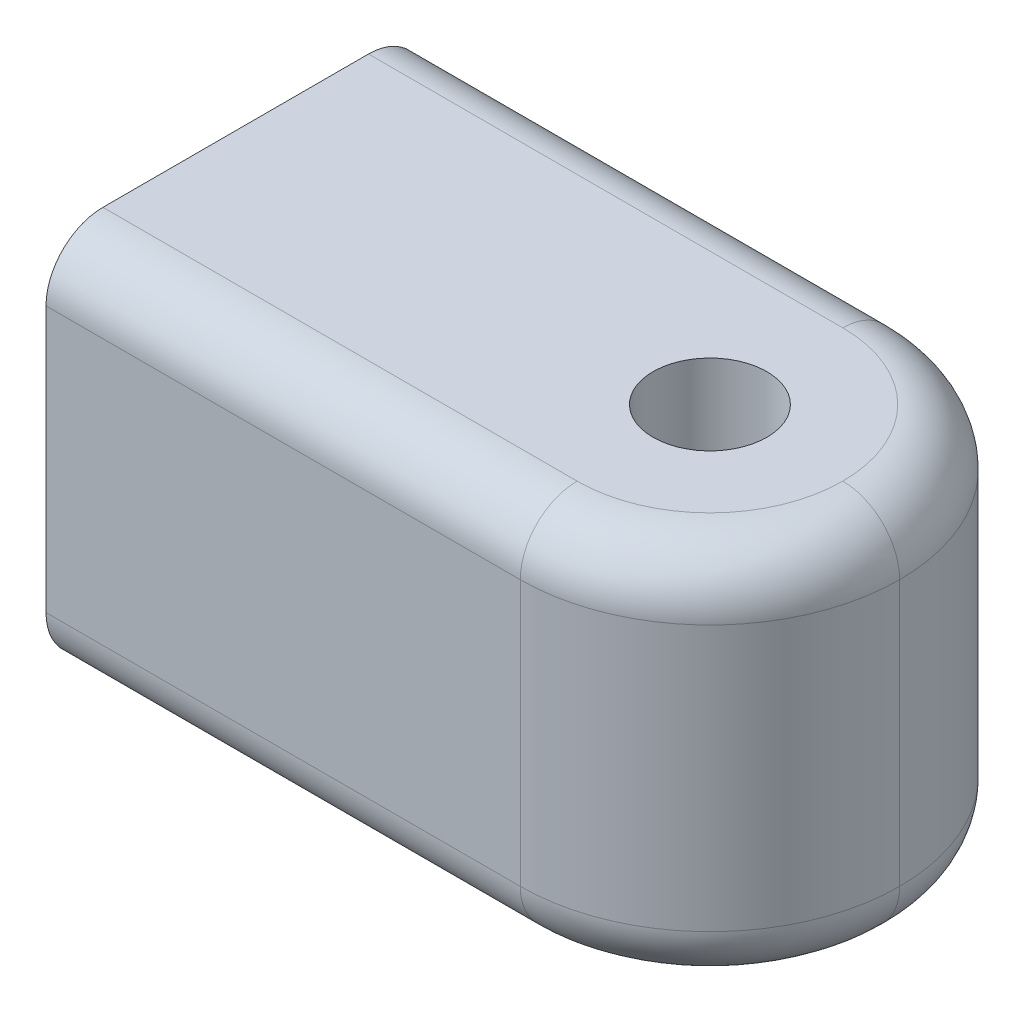
ISO-10303-21;
HEADER;
FILE_DESCRIPTION(('STEP AP214'),'2;1');
FILE_NAME('part.step','',(''),(''),'','','');
FILE_SCHEMA(('AUTOMOTIVE_DESIGN { 1 0 10303 214 1 1 1 1 }'));
ENDSEC;
DATA;
#1=APPLICATION_CONTEXT('core data for automotive mechanical design processes');
#2=APPLICATION_PROTOCOL_DEFINITION('international standard','automotive_design',2000,#1);
#3=PRODUCT_CONTEXT('',#1,'mechanical');
#4=PRODUCT('Part','Part','',(#3));
#5=PRODUCT_RELATED_PRODUCT_CATEGORY('part','',(#4));
#6=PRODUCT_DEFINITION_FORMATION('','',#4);
#7=PRODUCT_DEFINITION_CONTEXT('part definition',#1,'design');
#8=PRODUCT_DEFINITION('design','',#6,#7);
#9=PRODUCT_DEFINITION_SHAPE('','',#8);
#10=(LENGTH_UNIT() NAMED_UNIT(*) SI_UNIT(.MILLI.,.METRE.));
#11=(NAMED_UNIT(*) PLANE_ANGLE_UNIT() SI_UNIT($,.RADIAN.));
#12=(NAMED_UNIT(*) SI_UNIT($,.STERADIAN.) SOLID_ANGLE_UNIT());
#13=UNCERTAINTY_MEASURE_WITH_UNIT(LENGTH_MEASURE(1.E-05),#10,'distance_accuracy_value','');
#14=(GEOMETRIC_REPRESENTATION_CONTEXT(3) GLOBAL_UNCERTAINTY_ASSIGNED_CONTEXT((#13)) GLOBAL_UNIT_ASSIGNED_CONTEXT((#10,
#11,#12)) REPRESENTATION_CONTEXT('',''));
#15=CARTESIAN_POINT('',(0.,0.,0.));
#16=DIRECTION('',(0.,0.,1.));
#17=DIRECTION('',(1.,0.,0.));
#18=AXIS2_PLACEMENT_3D('',#15,#16,#17);
#19=CARTESIAN_POINT('',(0.,0.,0.));
#20=DIRECTION('',(1.,0.,0.));
#21=DIRECTION('',(0.,0.,-1.));
#22=AXIS2_PLACEMENT_3D('',#19,#20,#21);
#23=PLANE('',#22);
#24=DIRECTION('',(0.,0.,-1.));
#25=VECTOR('',#24,1.);
#26=CARTESIAN_POINT('',(0.,-10.,10.));
#27=LINE('',#26,#25);
#28=CARTESIAN_POINT('',(0.,-10.,7.));
#29=VERTEX_POINT('',#28);
#30=CARTESIAN_POINT('',(0.,-10.,-7.));
#31=VERTEX_POINT('',#30);
#32=EDGE_CURVE('E149',#29,#31,#27,.T.);
#33=ORIENTED_EDGE('',*,*,#32,.F.);
#34=CARTESIAN_POINT('',(0.,-7.,7.));
#35=DIRECTION('',(1.,0.,0.));
#36=DIRECTION('',(0.,0.,-1.));
#37=AXIS2_PLACEMENT_3D('',#34,#35,#36);
#38=CIRCLE('',#37,3.);
#39=CARTESIAN_POINT('',(0.,-7.,10.));
#40=VERTEX_POINT('',#39);
#41=EDGE_CURVE('E133',#29,#40,#38,.F.);
#42=ORIENTED_EDGE('',*,*,#41,.T.);
#43=DIRECTION('',(0.,1.,0.));
#44=VECTOR('',#43,1.);
#45=CARTESIAN_POINT('',(0.,-10.,10.));
#46=LINE('',#45,#44);
#47=CARTESIAN_POINT('',(0.,7.,10.));
#48=VERTEX_POINT('',#47);
#49=EDGE_CURVE('E160',#40,#48,#46,.T.);
#50=ORIENTED_EDGE('',*,*,#49,.T.);
#51=CARTESIAN_POINT('',(0.,7.,7.));
#52=DIRECTION('',(1.,0.,0.));
#53=DIRECTION('',(0.,0.,-1.));
#54=AXIS2_PLACEMENT_3D('',#51,#52,#53);
#55=CIRCLE('',#54,3.);
#56=CARTESIAN_POINT('',(0.,10.,7.));
#57=VERTEX_POINT('',#56);
#58=EDGE_CURVE('E144',#48,#57,#55,.F.);
#59=ORIENTED_EDGE('',*,*,#58,.T.);
#60=DIRECTION('',(0.,0.,-1.));
#61=VECTOR('',#60,1.);
#62=CARTESIAN_POINT('',(0.,10.,10.));
#63=LINE('',#62,#61);
#64=CARTESIAN_POINT('',(0.,10.,-7.));
#65=VERTEX_POINT('',#64);
#66=EDGE_CURVE('E166',#57,#65,#63,.T.);
#67=ORIENTED_EDGE('',*,*,#66,.T.);
#68=CARTESIAN_POINT('',(0.,7.,-7.));
#69=DIRECTION('',(1.,0.,0.));
#70=DIRECTION('',(0.,0.,-1.));
#71=AXIS2_PLACEMENT_3D('',#68,#69,#70);
#72=CIRCLE('',#71,3.);
#73=CARTESIAN_POINT('',(0.,7.,-10.));
#74=VERTEX_POINT('',#73);
#75=EDGE_CURVE('E154',#65,#74,#72,.F.);
#76=ORIENTED_EDGE('',*,*,#75,.T.);
#77=DIRECTION('',(0.,1.,0.));
#78=VECTOR('',#77,1.);
#79=CARTESIAN_POINT('',(0.,-10.,-10.));
#80=LINE('',#79,#78);
#81=CARTESIAN_POINT('',(0.,-7.,-10.));
#82=VERTEX_POINT('',#81);
#83=EDGE_CURVE('E161',#82,#74,#80,.T.);
#84=ORIENTED_EDGE('',*,*,#83,.F.);
#85=CARTESIAN_POINT('',(0.,-7.,-7.));
#86=DIRECTION('',(1.,0.,0.));
#87=DIRECTION('',(0.,0.,-1.));
#88=AXIS2_PLACEMENT_3D('',#85,#86,#87);
#89=CIRCLE('',#88,3.);
#90=EDGE_CURVE('E159',#82,#31,#89,.F.);
#91=ORIENTED_EDGE('',*,*,#90,.T.);
#92=EDGE_LOOP('',(#33,#42,#50,#59,#67,#76,#84,#91));
#93=FACE_BOUND('',#92,.T.);
#94=CARTESIAN_POINT('',(0.,0.,0.));
#95=DIRECTION('',(1.,0.,0.));
#96=DIRECTION('',(0.,0.,-1.));
#97=AXIS2_PLACEMENT_3D('',#94,#95,#96);
#98=CIRCLE('',#97,5.3);
#99=CARTESIAN_POINT('',(0.,0.,-5.3));
#100=VERTEX_POINT('',#99);
#101=EDGE_CURVE('E231',#100,#100,#98,.T.);
#102=ORIENTED_EDGE('',*,*,#101,.T.);
#103=EDGE_LOOP('',(#102));
#104=FACE_BOUND('',#103,.T.);
#105=ADVANCED_FACE('F56',(#93,#104),#23,.F.);
#106=CARTESIAN_POINT('',(10.,10.,10.));
#107=DIRECTION('',(0.,1.,0.));
#108=DIRECTION('',(0.,0.,1.));
#109=AXIS2_PLACEMENT_3D('',#106,#107,#108);
#110=PLANE('',#109);
#111=CARTESIAN_POINT('',(25.,10.,0.));
#112=DIRECTION('',(0.,1.,0.));
#113=DIRECTION('',(0.,0.,1.));
#114=AXIS2_PLACEMENT_3D('',#111,#112,#113);
#115=CIRCLE('',#114,2.99999999999999);
#116=CARTESIAN_POINT('',(25.,10.,2.99999999999999));
#117=VERTEX_POINT('',#116);
#118=EDGE_CURVE('E179',#117,#117,#115,.T.);
#119=ORIENTED_EDGE('',*,*,#118,.F.);
#120=EDGE_LOOP('',(#119));
#121=FACE_BOUND('',#120,.T.);
#122=ORIENTED_EDGE('',*,*,#66,.F.);
#123=DIRECTION('',(-1.,0.,0.));
#124=VECTOR('',#123,1.);
#125=CARTESIAN_POINT('',(10.,10.,7.));
#126=LINE('',#125,#124);
#127=CARTESIAN_POINT('',(25.,10.,7.));
#128=VERTEX_POINT('',#127);
#129=EDGE_CURVE('E73',#57,#128,#126,.F.);
#130=ORIENTED_EDGE('',*,*,#129,.T.);
#131=CARTESIAN_POINT('',(25.,10.,0.));
#132=DIRECTION('',(0.,1.,0.));
#133=DIRECTION('',(0.,0.,1.));
#134=AXIS2_PLACEMENT_3D('',#131,#132,#133);
#135=CIRCLE('',#134,7.);
#136=CARTESIAN_POINT('',(32.,10.,0.));
#137=VERTEX_POINT('',#136);
#138=EDGE_CURVE('E77',#128,#137,#135,.T.);
#139=ORIENTED_EDGE('',*,*,#138,.T.);
#140=CARTESIAN_POINT('',(25.,10.,0.));
#141=DIRECTION('',(0.,1.,0.));
#142=DIRECTION('',(0.,0.,1.));
#143=AXIS2_PLACEMENT_3D('',#140,#141,#142);
#144=CIRCLE('',#143,7.);
#145=CARTESIAN_POINT('',(25.,10.,-7.));
#146=VERTEX_POINT('',#145);
#147=EDGE_CURVE('E201',#137,#146,#144,.T.);
#148=ORIENTED_EDGE('',*,*,#147,.T.);
#149=DIRECTION('',(-1.,0.,0.));
#150=VECTOR('',#149,1.);
#151=CARTESIAN_POINT('',(0.,10.,-7.));
#152=LINE('',#151,#150);
#153=EDGE_CURVE('E199',#146,#65,#152,.T.);
#154=ORIENTED_EDGE('',*,*,#153,.T.);
#155=EDGE_LOOP('',(#122,#130,#139,#148,#154));
#156=FACE_BOUND('',#155,.T.);
#157=ADVANCED_FACE('F230',(#121,#156),#110,.T.);
#158=CARTESIAN_POINT('',(10.,-10.,10.));
#159=DIRECTION('',(0.,0.,1.));
#160=DIRECTION('',(1.,0.,0.));
#161=AXIS2_PLACEMENT_3D('',#158,#159,#160);
#162=PLANE('',#161);
#163=ORIENTED_EDGE('',*,*,#49,.F.);
#164=DIRECTION('',(-1.,0.,0.));
#165=VECTOR('',#164,1.);
#166=CARTESIAN_POINT('',(25.,-7.,10.));
#167=LINE('',#166,#165);
#168=CARTESIAN_POINT('',(25.,-7.,10.));
#169=VERTEX_POINT('',#168);
#170=EDGE_CURVE('E138',#40,#169,#167,.F.);
#171=ORIENTED_EDGE('',*,*,#170,.T.);
#172=DIRECTION('',(0.,-1.,0.));
#173=VECTOR('',#172,1.);
#174=CARTESIAN_POINT('',(25.,10.,10.));
#175=LINE('',#174,#173);
#176=CARTESIAN_POINT('',(25.,7.,10.));
#177=VERTEX_POINT('',#176);
#178=EDGE_CURVE('E163',#169,#177,#175,.F.);
#179=ORIENTED_EDGE('',*,*,#178,.T.);
#180=DIRECTION('',(-1.,0.,0.));
#181=VECTOR('',#180,1.);
#182=CARTESIAN_POINT('',(10.,7.,10.));
#183=LINE('',#182,#181);
#184=EDGE_CURVE('E143',#177,#48,#183,.T.);
#185=ORIENTED_EDGE('',*,*,#184,.T.);
#186=EDGE_LOOP('',(#163,#171,#179,#185));
#187=FACE_BOUND('',#186,.T.);
#188=ADVANCED_FACE('F247',(#187),#162,.T.);
#189=CARTESIAN_POINT('',(10.,-10.,10.));
#190=DIRECTION('',(0.,1.,0.));
#191=DIRECTION('',(0.,0.,1.));
#192=AXIS2_PLACEMENT_3D('',#189,#190,#191);
#193=PLANE('',#192);
#194=CARTESIAN_POINT('',(25.,-10.,0.));
#195=DIRECTION('',(0.,1.,0.));
#196=DIRECTION('',(0.,0.,1.));
#197=AXIS2_PLACEMENT_3D('',#194,#195,#196);
#198=CIRCLE('',#197,3.);
#199=CARTESIAN_POINT('',(25.,-10.,2.99999999999999));
#200=VERTEX_POINT('',#199);
#201=EDGE_CURVE('E238',#200,#200,#198,.T.);
#202=ORIENTED_EDGE('',*,*,#201,.T.);
#203=EDGE_LOOP('',(#202));
#204=FACE_BOUND('',#203,.T.);
#205=CARTESIAN_POINT('',(25.,-10.,0.));
#206=DIRECTION('',(0.,1.,0.));
#207=DIRECTION('',(0.,0.,1.));
#208=AXIS2_PLACEMENT_3D('',#205,#206,#207);
#209=CIRCLE('',#208,7.);
#210=CARTESIAN_POINT('',(32.,-10.,0.));
#211=VERTEX_POINT('',#210);
#212=CARTESIAN_POINT('',(25.,-10.,7.));
#213=VERTEX_POINT('',#212);
#214=EDGE_CURVE('E152',#211,#213,#209,.F.);
#215=ORIENTED_EDGE('',*,*,#214,.T.);
#216=DIRECTION('',(-1.,0.,0.));
#217=VECTOR('',#216,1.);
#218=CARTESIAN_POINT('',(0.,-10.,7.));
#219=LINE('',#218,#217);
#220=EDGE_CURVE('E137',#213,#29,#219,.T.);
#221=ORIENTED_EDGE('',*,*,#220,.T.);
#222=ORIENTED_EDGE('',*,*,#32,.T.);
#223=DIRECTION('',(-1.,0.,0.));
#224=VECTOR('',#223,1.);
#225=CARTESIAN_POINT('',(10.,-10.,-7.));
#226=LINE('',#225,#224);
#227=CARTESIAN_POINT('',(25.,-10.,-7.));
#228=VERTEX_POINT('',#227);
#229=EDGE_CURVE('E175',#31,#228,#226,.F.);
#230=ORIENTED_EDGE('',*,*,#229,.T.);
#231=CARTESIAN_POINT('',(25.,-10.,0.));
#232=DIRECTION('',(0.,1.,0.));
#233=DIRECTION('',(0.,0.,1.));
#234=AXIS2_PLACEMENT_3D('',#231,#232,#233);
#235=CIRCLE('',#234,7.);
#236=EDGE_CURVE('E182',#228,#211,#235,.F.);
#237=ORIENTED_EDGE('',*,*,#236,.T.);
#238=EDGE_LOOP('',(#215,#221,#222,#230,#237));
#239=FACE_BOUND('',#238,.T.);
#240=ADVANCED_FACE('F148',(#204,#239),#193,.F.);
#241=CARTESIAN_POINT('',(10.,-10.,-10.));
#242=DIRECTION('',(0.,0.,1.));
#243=DIRECTION('',(1.,0.,0.));
#244=AXIS2_PLACEMENT_3D('',#241,#242,#243);
#245=PLANE('',#244);
#246=DIRECTION('',(0.,1.,0.));
#247=VECTOR('',#246,1.);
#248=CARTESIAN_POINT('',(25.,-10.,-10.));
#249=LINE('',#248,#247);
#250=CARTESIAN_POINT('',(25.,7.,-10.));
#251=VERTEX_POINT('',#250);
#252=CARTESIAN_POINT('',(25.,-7.,-10.));
#253=VERTEX_POINT('',#252);
#254=EDGE_CURVE('E172',#251,#253,#249,.F.);
#255=ORIENTED_EDGE('',*,*,#254,.T.);
#256=DIRECTION('',(-1.,0.,0.));
#257=VECTOR('',#256,1.);
#258=CARTESIAN_POINT('',(10.,-7.,-10.));
#259=LINE('',#258,#257);
#260=EDGE_CURVE('E12',#253,#82,#259,.T.);
#261=ORIENTED_EDGE('',*,*,#260,.T.);
#262=ORIENTED_EDGE('',*,*,#83,.T.);
#263=DIRECTION('',(-1.,0.,0.));
#264=VECTOR('',#263,1.);
#265=CARTESIAN_POINT('',(25.,7.,-10.));
#266=LINE('',#265,#264);
#267=EDGE_CURVE('E65',#74,#251,#266,.F.);
#268=ORIENTED_EDGE('',*,*,#267,.T.);
#269=EDGE_LOOP('',(#255,#261,#262,#268));
#270=FACE_BOUND('',#269,.T.);
#271=ADVANCED_FACE('F258',(#270),#245,.F.);
#272=CARTESIAN_POINT('',(10.,0.,0.));
#273=DIRECTION('',(-1.,0.,0.));
#274=DIRECTION('',(0.,0.,1.));
#275=AXIS2_PLACEMENT_3D('',#272,#273,#274);
#276=CYLINDRICAL_SURFACE('',#275,5.3);
#277=CARTESIAN_POINT('',(10.,0.,0.));
#278=DIRECTION('',(1.,0.,0.));
#279=DIRECTION('',(0.,0.,-1.));
#280=AXIS2_PLACEMENT_3D('',#277,#278,#279);
#281=CIRCLE('',#280,5.3);
#282=CARTESIAN_POINT('',(10.,0.,-5.3));
#283=VERTEX_POINT('',#282);
#284=EDGE_CURVE('E233',#283,#283,#281,.T.);
#285=ORIENTED_EDGE('',*,*,#284,.T.);
#286=EDGE_LOOP('',(#285));
#287=FACE_BOUND('',#286,.T.);
#288=ORIENTED_EDGE('',*,*,#101,.F.);
#289=EDGE_LOOP('',(#288));
#290=FACE_BOUND('',#289,.T.);
#291=ADVANCED_FACE('F328',(#287,#290),#276,.F.);
#292=CARTESIAN_POINT('',(10.,0.,0.));
#293=DIRECTION('',(1.,0.,0.));
#294=DIRECTION('',(0.,0.,-1.));
#295=AXIS2_PLACEMENT_3D('',#292,#293,#294);
#296=PLANE('',#295);
#297=ORIENTED_EDGE('',*,*,#284,.F.);
#298=EDGE_LOOP('',(#297));
#299=FACE_BOUND('',#298,.T.);
#300=ADVANCED_FACE('F356',(#299),#296,.F.);
#301=CARTESIAN_POINT('',(25.,10.,0.));
#302=DIRECTION('',(0.,1.,0.));
#303=DIRECTION('',(0.,0.,1.));
#304=AXIS2_PLACEMENT_3D('',#301,#302,#303);
#305=CYLINDRICAL_SURFACE('',#304,2.99999999999999);
#306=ORIENTED_EDGE('',*,*,#201,.F.);
#307=EDGE_LOOP('',(#306));
#308=FACE_BOUND('',#307,.T.);
#309=ORIENTED_EDGE('',*,*,#118,.T.);
#310=EDGE_LOOP('',(#309));
#311=FACE_BOUND('',#310,.T.);
#312=ADVANCED_FACE('F244',(#308,#311),#305,.F.);
#313=CARTESIAN_POINT('',(25.,0.,0.));
#314=DIRECTION('',(0.,1.,0.));
#315=DIRECTION('',(0.,0.,1.));
#316=AXIS2_PLACEMENT_3D('',#313,#314,#315);
#317=CYLINDRICAL_SURFACE('',#316,10.);
#318=DIRECTION('',(0.,1.,0.));
#319=VECTOR('',#318,1.);
#320=CARTESIAN_POINT('',(35.,0.,0.));
#321=LINE('',#320,#319);
#322=CARTESIAN_POINT('',(35.,-7.,0.));
#323=VERTEX_POINT('',#322);
#324=CARTESIAN_POINT('',(35.,7.,0.));
#325=VERTEX_POINT('',#324);
#326=EDGE_CURVE('E176',#323,#325,#321,.T.);
#327=ORIENTED_EDGE('',*,*,#326,.F.);
#328=CARTESIAN_POINT('',(25.,-7.,0.));
#329=DIRECTION('',(0.,1.,0.));
#330=DIRECTION('',(0.,0.,1.));
#331=AXIS2_PLACEMENT_3D('',#328,#329,#330);
#332=CIRCLE('',#331,10.);
#333=EDGE_CURVE('E197',#323,#253,#332,.T.);
#334=ORIENTED_EDGE('',*,*,#333,.T.);
#335=ORIENTED_EDGE('',*,*,#254,.F.);
#336=CARTESIAN_POINT('',(25.,7.,0.));
#337=DIRECTION('',(0.,1.,0.));
#338=DIRECTION('',(0.,0.,1.));
#339=AXIS2_PLACEMENT_3D('',#336,#337,#338);
#340=CIRCLE('',#339,10.);
#341=EDGE_CURVE('E195',#251,#325,#340,.F.);
#342=ORIENTED_EDGE('',*,*,#341,.T.);
#343=EDGE_LOOP('',(#327,#334,#335,#342));
#344=FACE_BOUND('',#343,.T.);
#345=ADVANCED_FACE('F264',(#344),#317,.T.);
#346=CARTESIAN_POINT('',(25.,0.,0.));
#347=DIRECTION('',(0.,1.,0.));
#348=DIRECTION('',(0.,0.,1.));
#349=AXIS2_PLACEMENT_3D('',#346,#347,#348);
#350=CYLINDRICAL_SURFACE('',#349,10.);
#351=ORIENTED_EDGE('',*,*,#178,.F.);
#352=CARTESIAN_POINT('',(25.,-7.,0.));
#353=DIRECTION('',(0.,1.,0.));
#354=DIRECTION('',(0.,0.,1.));
#355=AXIS2_PLACEMENT_3D('',#352,#353,#354);
#356=CIRCLE('',#355,10.);
#357=EDGE_CURVE('E193',#169,#323,#356,.T.);
#358=ORIENTED_EDGE('',*,*,#357,.T.);
#359=ORIENTED_EDGE('',*,*,#326,.T.);
#360=CARTESIAN_POINT('',(25.,7.,0.));
#361=DIRECTION('',(0.,1.,0.));
#362=DIRECTION('',(0.,0.,1.));
#363=AXIS2_PLACEMENT_3D('',#360,#361,#362);
#364=CIRCLE('',#363,10.);
#365=EDGE_CURVE('E191',#325,#177,#364,.F.);
#366=ORIENTED_EDGE('',*,*,#365,.T.);
#367=EDGE_LOOP('',(#351,#358,#359,#366));
#368=FACE_BOUND('',#367,.T.);
#369=ADVANCED_FACE('F260',(#368),#350,.T.);
#370=CARTESIAN_POINT('',(10.,-7.,-7.));
#371=DIRECTION('',(-1.,0.,0.));
#372=DIRECTION('',(0.,0.,1.));
#373=AXIS2_PLACEMENT_3D('',#370,#371,#372);
#374=CYLINDRICAL_SURFACE('',#373,3.);
#375=ORIENTED_EDGE('',*,*,#90,.F.);
#376=ORIENTED_EDGE('',*,*,#260,.F.);
#377=CARTESIAN_POINT('',(25.,-7.,-7.));
#378=DIRECTION('',(1.,0.,0.));
#379=DIRECTION('',(0.,0.,-1.));
#380=AXIS2_PLACEMENT_3D('',#377,#378,#379);
#381=CIRCLE('',#380,3.);
#382=EDGE_CURVE('E180',#228,#253,#381,.T.);
#383=ORIENTED_EDGE('',*,*,#382,.F.);
#384=ORIENTED_EDGE('',*,*,#229,.F.);
#385=EDGE_LOOP('',(#375,#376,#383,#384));
#386=FACE_BOUND('',#385,.T.);
#387=ADVANCED_FACE('F263',(#386),#374,.T.);
#388=CARTESIAN_POINT('',(25.,-7.,0.));
#389=DIRECTION('',(0.,1.,0.));
#390=DIRECTION('',(0.,0.,1.));
#391=AXIS2_PLACEMENT_3D('',#388,#389,#390);
#392=TOROIDAL_SURFACE('',#391,7.,3.);
#393=ORIENTED_EDGE('',*,*,#382,.T.);
#394=ORIENTED_EDGE('',*,*,#333,.F.);
#395=CARTESIAN_POINT('',(32.,-7.,0.));
#396=DIRECTION('',(0.,0.,1.));
#397=DIRECTION('',(1.,0.,0.));
#398=AXIS2_PLACEMENT_3D('',#395,#396,#397);
#399=CIRCLE('',#398,3.);
#400=EDGE_CURVE('E208',#211,#323,#399,.T.);
#401=ORIENTED_EDGE('',*,*,#400,.F.);
#402=ORIENTED_EDGE('',*,*,#236,.F.);
#403=EDGE_LOOP('',(#393,#394,#401,#402));
#404=FACE_BOUND('',#403,.T.);
#405=ADVANCED_FACE('F274',(#404),#392,.T.);
#406=CARTESIAN_POINT('',(25.,-7.,0.));
#407=DIRECTION('',(0.,1.,0.));
#408=DIRECTION('',(0.,0.,1.));
#409=AXIS2_PLACEMENT_3D('',#406,#407,#408);
#410=TOROIDAL_SURFACE('',#409,7.,3.);
#411=ORIENTED_EDGE('',*,*,#400,.T.);
#412=ORIENTED_EDGE('',*,*,#357,.F.);
#413=CARTESIAN_POINT('',(25.,-7.,7.));
#414=DIRECTION('',(-1.,0.,0.));
#415=DIRECTION('',(0.,0.,1.));
#416=AXIS2_PLACEMENT_3D('',#413,#414,#415);
#417=CIRCLE('',#416,3.);
#418=EDGE_CURVE('E206',#213,#169,#417,.T.);
#419=ORIENTED_EDGE('',*,*,#418,.F.);
#420=ORIENTED_EDGE('',*,*,#214,.F.);
#421=EDGE_LOOP('',(#411,#412,#419,#420));
#422=FACE_BOUND('',#421,.T.);
#423=ADVANCED_FACE('F271',(#422),#410,.T.);
#424=CARTESIAN_POINT('',(10.,-7.,7.));
#425=DIRECTION('',(1.,0.,0.));
#426=DIRECTION('',(0.,0.,-1.));
#427=AXIS2_PLACEMENT_3D('',#424,#425,#426);
#428=CYLINDRICAL_SURFACE('',#427,3.);
#429=ORIENTED_EDGE('',*,*,#418,.T.);
#430=ORIENTED_EDGE('',*,*,#170,.F.);
#431=ORIENTED_EDGE('',*,*,#41,.F.);
#432=ORIENTED_EDGE('',*,*,#220,.F.);
#433=EDGE_LOOP('',(#429,#430,#431,#432));
#434=FACE_BOUND('',#433,.T.);
#435=ADVANCED_FACE('F136',(#434),#428,.T.);
#436=CARTESIAN_POINT('',(10.,7.,-7.));
#437=DIRECTION('',(1.,0.,0.));
#438=DIRECTION('',(0.,0.,-1.));
#439=AXIS2_PLACEMENT_3D('',#436,#437,#438);
#440=CYLINDRICAL_SURFACE('',#439,3.);
#441=ORIENTED_EDGE('',*,*,#75,.F.);
#442=ORIENTED_EDGE('',*,*,#153,.F.);
#443=CARTESIAN_POINT('',(25.,7.,-7.));
#444=DIRECTION('',(1.,0.,0.));
#445=DIRECTION('',(0.,0.,-1.));
#446=AXIS2_PLACEMENT_3D('',#443,#444,#445);
#447=CIRCLE('',#446,3.);
#448=EDGE_CURVE('E60',#251,#146,#447,.T.);
#449=ORIENTED_EDGE('',*,*,#448,.F.);
#450=ORIENTED_EDGE('',*,*,#267,.F.);
#451=EDGE_LOOP('',(#441,#442,#449,#450));
#452=FACE_BOUND('',#451,.T.);
#453=ADVANCED_FACE('F58',(#452),#440,.T.);
#454=CARTESIAN_POINT('',(25.,7.,0.));
#455=DIRECTION('',(0.,1.,0.));
#456=DIRECTION('',(0.,0.,1.));
#457=AXIS2_PLACEMENT_3D('',#454,#455,#456);
#458=TOROIDAL_SURFACE('',#457,7.,3.);
#459=ORIENTED_EDGE('',*,*,#448,.T.);
#460=ORIENTED_EDGE('',*,*,#147,.F.);
#461=CARTESIAN_POINT('',(32.,7.,0.));
#462=DIRECTION('',(0.,0.,1.));
#463=DIRECTION('',(1.,0.,0.));
#464=AXIS2_PLACEMENT_3D('',#461,#462,#463);
#465=CIRCLE('',#464,3.);
#466=EDGE_CURVE('E215',#325,#137,#465,.T.);
#467=ORIENTED_EDGE('',*,*,#466,.F.);
#468=ORIENTED_EDGE('',*,*,#341,.F.);
#469=EDGE_LOOP('',(#459,#460,#467,#468));
#470=FACE_BOUND('',#469,.T.);
#471=ADVANCED_FACE('F224',(#470),#458,.T.);
#472=CARTESIAN_POINT('',(25.,7.,0.));
#473=DIRECTION('',(0.,1.,0.));
#474=DIRECTION('',(0.,0.,1.));
#475=AXIS2_PLACEMENT_3D('',#472,#473,#474);
#476=TOROIDAL_SURFACE('',#475,7.,3.);
#477=ORIENTED_EDGE('',*,*,#466,.T.);
#478=ORIENTED_EDGE('',*,*,#138,.F.);
#479=CARTESIAN_POINT('',(25.,7.,7.));
#480=DIRECTION('',(-1.,0.,0.));
#481=DIRECTION('',(0.,0.,1.));
#482=AXIS2_PLACEMENT_3D('',#479,#480,#481);
#483=CIRCLE('',#482,3.);
#484=EDGE_CURVE('E213',#177,#128,#483,.T.);
#485=ORIENTED_EDGE('',*,*,#484,.F.);
#486=ORIENTED_EDGE('',*,*,#365,.F.);
#487=EDGE_LOOP('',(#477,#478,#485,#486));
#488=FACE_BOUND('',#487,.T.);
#489=ADVANCED_FACE('F285',(#488),#476,.T.);
#490=CARTESIAN_POINT('',(10.,7.,7.));
#491=DIRECTION('',(-1.,0.,0.));
#492=DIRECTION('',(0.,0.,1.));
#493=AXIS2_PLACEMENT_3D('',#490,#491,#492);
#494=CYLINDRICAL_SURFACE('',#493,3.);
#495=ORIENTED_EDGE('',*,*,#484,.T.);
#496=ORIENTED_EDGE('',*,*,#129,.F.);
#497=ORIENTED_EDGE('',*,*,#58,.F.);
#498=ORIENTED_EDGE('',*,*,#184,.F.);
#499=EDGE_LOOP('',(#495,#496,#497,#498));
#500=FACE_BOUND('',#499,.T.);
#501=ADVANCED_FACE('F282',(#500),#494,.T.);
#502=CLOSED_SHELL('',(#105,#157,#188,#240,#271,#291,#300,#312,#345,#369,#387,#405,#423,#435,
#453,#471,#489,#501));
#503=MANIFOLD_SOLID_BREP('B2',#502);
#504=ADVANCED_BREP_SHAPE_REPRESENTATION('',(#18,#503),#14);
#505=SHAPE_DEFINITION_REPRESENTATION(#9,#504);
ENDSEC;
END-ISO-10303-21;
